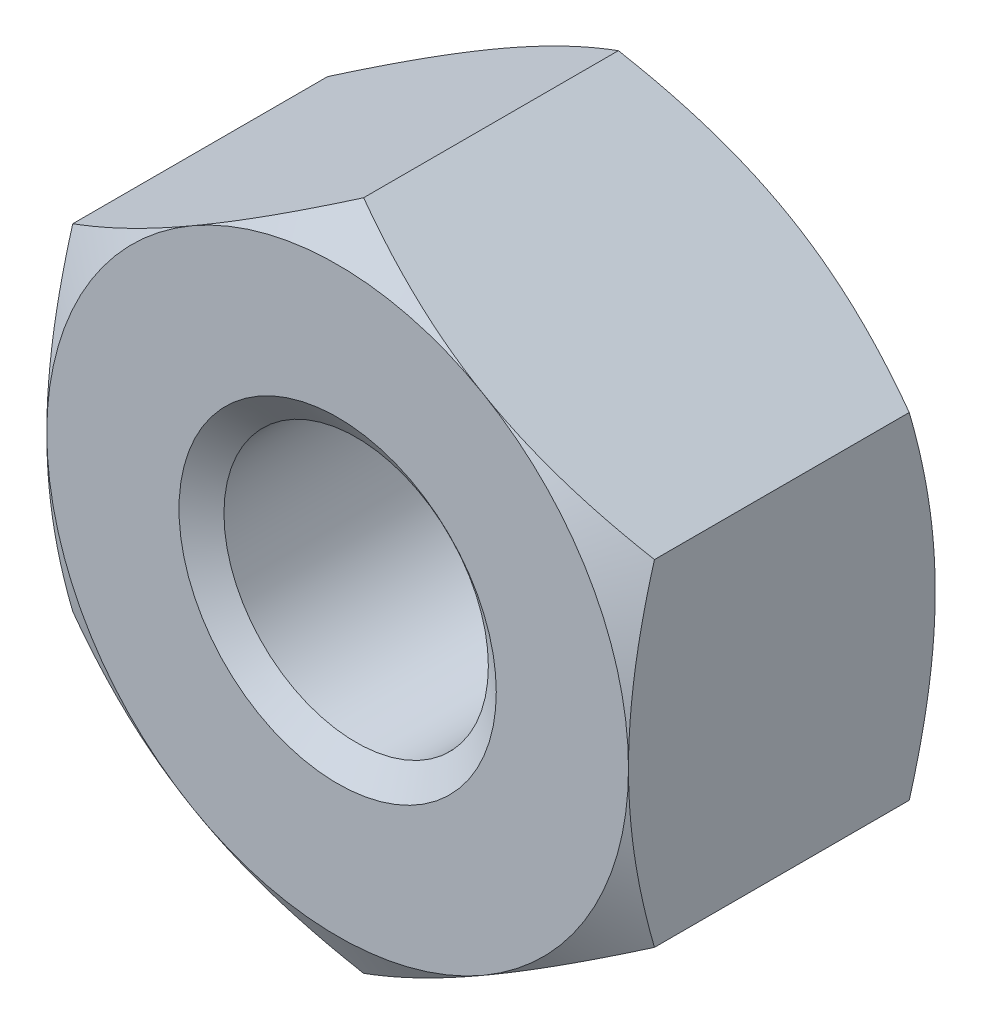
ISO-10303-21;
HEADER;
FILE_DESCRIPTION(('STEP AP214'),'2;1');
FILE_NAME('part.step','',(''),(''),'','','');
FILE_SCHEMA(('AUTOMOTIVE_DESIGN { 1 0 10303 214 1 1 1 1 }'));
ENDSEC;
DATA;
#1=APPLICATION_CONTEXT('core data for automotive mechanical design processes');
#2=APPLICATION_PROTOCOL_DEFINITION('international standard','automotive_design',2000,#1);
#3=PRODUCT_CONTEXT('',#1,'mechanical');
#4=PRODUCT('Part','Part','',(#3));
#5=PRODUCT_RELATED_PRODUCT_CATEGORY('part','',(#4));
#6=PRODUCT_DEFINITION_FORMATION('','',#4);
#7=PRODUCT_DEFINITION_CONTEXT('part definition',#1,'design');
#8=PRODUCT_DEFINITION('design','',#6,#7);
#9=PRODUCT_DEFINITION_SHAPE('','',#8);
#10=(LENGTH_UNIT() NAMED_UNIT(*) SI_UNIT(.MILLI.,.METRE.));
#11=(NAMED_UNIT(*) PLANE_ANGLE_UNIT() SI_UNIT($,.RADIAN.));
#12=(NAMED_UNIT(*) SI_UNIT($,.STERADIAN.) SOLID_ANGLE_UNIT());
#13=UNCERTAINTY_MEASURE_WITH_UNIT(LENGTH_MEASURE(1.E-05),#10,'distance_accuracy_value','');
#14=(GEOMETRIC_REPRESENTATION_CONTEXT(3) GLOBAL_UNCERTAINTY_ASSIGNED_CONTEXT((#13)) GLOBAL_UNIT_ASSIGNED_CONTEXT((#10,
#11,#12)) REPRESENTATION_CONTEXT('',''));
#15=CARTESIAN_POINT('',(0.,0.,0.));
#16=DIRECTION('',(0.,0.,1.));
#17=DIRECTION('',(1.,0.,0.));
#18=AXIS2_PLACEMENT_3D('',#15,#16,#17);
#19=CARTESIAN_POINT('',(0.,0.,-2.9));
#20=DIRECTION('',(0.,0.,1.));
#21=DIRECTION('',(1.,0.,0.));
#22=AXIS2_PLACEMENT_3D('',#19,#20,#21);
#23=CYLINDRICAL_SURFACE('',#22,1.25);
#24=CARTESIAN_POINT('',(0.,0.,-0.175051884552436));
#25=DIRECTION('',(0.,0.,1.));
#26=DIRECTION('',(1.,0.,0.));
#27=AXIS2_PLACEMENT_3D('',#24,#25,#26);
#28=CIRCLE('',#27,1.25);
#29=CARTESIAN_POINT('',(1.25,0.,-0.175051884552436));
#30=VERTEX_POINT('',#29);
#31=EDGE_CURVE('E175',#30,#30,#28,.F.);
#32=ORIENTED_EDGE('',*,*,#31,.F.);
#33=EDGE_LOOP('',(#32));
#34=FACE_BOUND('',#33,.T.);
#35=CARTESIAN_POINT('',(0.,0.,-2.69954811544756));
#36=DIRECTION('',(0.,0.,-1.));
#37=DIRECTION('',(-1.,0.,0.));
#38=AXIS2_PLACEMENT_3D('',#35,#36,#37);
#39=CIRCLE('',#38,1.25);
#40=CARTESIAN_POINT('',(-1.25,0.,-2.69954811544756));
#41=VERTEX_POINT('',#40);
#42=EDGE_CURVE('E40',#41,#41,#39,.F.);
#43=ORIENTED_EDGE('',*,*,#42,.F.);
#44=EDGE_LOOP('',(#43));
#45=FACE_BOUND('',#44,.T.);
#46=ADVANCED_FACE('F35',(#34,#45),#23,.F.);
#47=CARTESIAN_POINT('',(0.,3.17542648054296,-2.9));
#48=DIRECTION('',(-0.500000000000008,0.866025403784434,0.));
#49=DIRECTION('',(-0.866025403784434,-0.500000000000008,0.));
#50=AXIS2_PLACEMENT_3D('',#47,#48,#49);
#51=PLANE('',#50);
#52=DIRECTION('',(0.,0.,1.));
#53=VECTOR('',#52,1.);
#54=CARTESIAN_POINT('',(-2.75,1.58771324027145,-2.9));
#55=LINE('',#54,#53);
#56=CARTESIAN_POINT('',(-2.75,1.58771324027151,-2.65437990693813));
#57=VERTEX_POINT('',#56);
#58=CARTESIAN_POINT('',(-2.75,1.58771324027145,-0.245620093061857));
#59=VERTEX_POINT('',#58);
#60=EDGE_CURVE('E165',#57,#59,#55,.T.);
#61=ORIENTED_EDGE('',*,*,#60,.T.);
#62=CARTESIAN_POINT('',(-2.7502,1.58759777021761,-0.245686763364755));
#63=CARTESIAN_POINT('',(-2.62935077934009,1.65737010029697,-0.205387662249258));
#64=CARTESIAN_POINT('',(-2.50745839737737,1.72774469983531,-0.168736902597657));
#65=CARTESIAN_POINT('',(-2.26156287327211,1.86971254687001,-0.104762182969796));
#66=CARTESIAN_POINT('',(-2.13755536142615,1.94130831721582,-0.0774608556744926));
#67=CARTESIAN_POINT('',(-1.89107720202406,2.08361254889598,-0.0349617452941124));
#68=CARTESIAN_POINT('',(-1.76864448141259,2.15429911309863,-0.0194811186224536));
#69=CARTESIAN_POINT('',(-1.52320285763109,2.29600490065922,-0.000999397369936881));
#70=CARTESIAN_POINT('',(-1.4001948467671,2.36702360884403,0.00201700053740344));
#71=CARTESIAN_POINT('',(-1.17034121338921,2.49972966594897,-0.00425314542854458));
#72=CARTESIAN_POINT('',(-1.06346120874599,2.56143686540072,-0.012000154276701));
#73=CARTESIAN_POINT('',(-0.850397532665256,2.68444923614047,-0.036555181064355));
#74=CARTESIAN_POINT('',(-0.744214598351115,2.74575398185008,-0.0533715896505715));
#75=CARTESIAN_POINT('',(-0.530711510606819,2.86902004703207,-0.0954119223459598));
#76=CARTESIAN_POINT('',(-0.423418383857147,2.93096576264319,-0.120814080687235));
#77=CARTESIAN_POINT('',(-0.210432520715949,3.05393320806135,-0.178467225839989));
#78=CARTESIAN_POINT('',(-0.104737054973347,3.11495651365997,-0.210704663298991));
#79=CARTESIAN_POINT('',(0.000200000000001419,3.1755419505968,-0.245686763364771));
#80=B_SPLINE_CURVE_WITH_KNOTS('',3,(#62,#63,#64,#65,#66,#67,#68,#69,#70,#71,#72,#73,#74,#75,#76,
#77,#78,#79),.UNSPECIFIED.,.F.,.F.,(4,2,2,2,2,2,2,2,4),(0.,0.435912828725888,0.872873557116331,
1.29901931904671,1.72464171213573,2.09526089052938,2.46622354066375,2.84541551798559,
3.22386274754526),.UNSPECIFIED.);
#81=CARTESIAN_POINT('',(-1.37500000000002,2.3815698604072,0.));
#82=VERTEX_POINT('',#81);
#83=EDGE_CURVE('E134',#59,#82,#80,.T.);
#84=ORIENTED_EDGE('',*,*,#83,.T.);
#85=CARTESIAN_POINT('',(0.,3.17542648054296,-0.245620093061873));
#86=VERTEX_POINT('',#85);
#87=EDGE_CURVE('E54',#82,#86,#80,.T.);
#88=ORIENTED_EDGE('',*,*,#87,.T.);
#89=DIRECTION('',(0.,0.,1.));
#90=VECTOR('',#89,1.);
#91=CARTESIAN_POINT('',(0.,3.17542648054296,-2.9));
#92=LINE('',#91,#90);
#93=CARTESIAN_POINT('',(0.,3.17542648054296,-2.65437990693813));
#94=VERTEX_POINT('',#93);
#95=EDGE_CURVE('E150',#94,#86,#92,.T.);
#96=ORIENTED_EDGE('',*,*,#95,.F.);
#97=CARTESIAN_POINT('',(-2.7502,1.58759777021761,-2.65431323663524));
#98=CARTESIAN_POINT('',(-2.62935077934009,1.65737010029697,-2.69461233775074));
#99=CARTESIAN_POINT('',(-2.50745839737737,1.72774469983531,-2.73126309740234));
#100=CARTESIAN_POINT('',(-2.26156287327211,1.86971254687001,-2.7952378170302));
#101=CARTESIAN_POINT('',(-2.13755536142615,1.94130831721582,-2.82253914432551));
#102=CARTESIAN_POINT('',(-1.89107720202406,2.08361254889598,-2.86503825470589));
#103=CARTESIAN_POINT('',(-1.76864448141259,2.15429911309863,-2.88051888137755));
#104=CARTESIAN_POINT('',(-1.52320285763109,2.29600490065922,-2.89900060263006));
#105=CARTESIAN_POINT('',(-1.4001948467671,2.36702360884403,-2.9020170005374));
#106=CARTESIAN_POINT('',(-1.17034121338921,2.49972966594897,-2.89574685457146));
#107=CARTESIAN_POINT('',(-1.06346120874599,2.56143686540072,-2.8879998457233));
#108=CARTESIAN_POINT('',(-0.850397532665256,2.68444923614047,-2.86344481893564));
#109=CARTESIAN_POINT('',(-0.744214598351115,2.74575398185008,-2.84662841034943));
#110=CARTESIAN_POINT('',(-0.530711510606819,2.86902004703207,-2.80458807765404));
#111=CARTESIAN_POINT('',(-0.423418383857147,2.93096576264319,-2.77918591931276));
#112=CARTESIAN_POINT('',(-0.210432520715949,3.05393320806135,-2.72153277416001));
#113=CARTESIAN_POINT('',(-0.104737054973347,3.11495651365997,-2.68929533670101));
#114=CARTESIAN_POINT('',(0.000200000000001414,3.1755419505968,-2.65431323663523));
#115=B_SPLINE_CURVE_WITH_KNOTS('',3,(#97,#98,#99,#100,#101,#102,#103,#104,#105,#106,#107,#108,
#109,#110,#111,#112,#113,#114),.UNSPECIFIED.,.F.,.F.,(4,2,2,2,2,2,2,2,4),(0.,0.435912828725888,
0.872873557116332,1.29901931904671,1.72464171213573,2.09526089052938,2.46622354066375,
2.84541551798559,3.22386274754526),.UNSPECIFIED.);
#116=CARTESIAN_POINT('',(-1.37500000000002,2.3815698604072,-2.9));
#117=VERTEX_POINT('',#116);
#118=EDGE_CURVE('E168',#117,#94,#115,.T.);
#119=ORIENTED_EDGE('',*,*,#118,.F.);
#120=EDGE_CURVE('E260',#57,#117,#115,.T.);
#121=ORIENTED_EDGE('',*,*,#120,.F.);
#122=EDGE_LOOP('',(#61,#84,#88,#96,#119,#121));
#123=FACE_BOUND('',#122,.T.);
#124=ADVANCED_FACE('F37',(#123),#51,.T.);
#125=CARTESIAN_POINT('',(2.75,1.58771324027146,-2.9));
#126=DIRECTION('',(0.500000000000008,0.866025403784434,0.));
#127=DIRECTION('',(-0.866025403784434,0.500000000000008,0.));
#128=AXIS2_PLACEMENT_3D('',#125,#126,#127);
#129=PLANE('',#128);
#130=ORIENTED_EDGE('',*,*,#95,.T.);
#131=CARTESIAN_POINT('',(-0.00019999999999841,3.1755419505968,-0.245686763364771));
#132=CARTESIAN_POINT('',(0.120649220659908,3.10576962051744,-0.205387662249272));
#133=CARTESIAN_POINT('',(0.242541602622636,3.03539502097909,-0.16873690259767));
#134=CARTESIAN_POINT('',(0.488437126727895,2.8934271739444,-0.104762182969806));
#135=CARTESIAN_POINT('',(0.612444638573857,2.82183140359859,-0.0774608556745017));
#136=CARTESIAN_POINT('',(0.858922797975946,2.67952717191843,-0.0349617452941191));
#137=CARTESIAN_POINT('',(0.981355518587419,2.60884060771578,-0.0194811186224591));
#138=CARTESIAN_POINT('',(1.22679714236892,2.46713482015519,-0.000999397369940009));
#139=CARTESIAN_POINT('',(1.34980515323291,2.39611611197038,0.00201700053740151));
#140=CARTESIAN_POINT('',(1.5796587866108,2.26341005486544,-0.00425314542854448));
#141=CARTESIAN_POINT('',(1.68653879125402,2.20170285541368,-0.0120001542766998));
#142=CARTESIAN_POINT('',(1.89960246733475,2.07869048467394,-0.0365551810643516));
#143=CARTESIAN_POINT('',(2.00578540164889,2.01738573896433,-0.0533715896505668));
#144=CARTESIAN_POINT('',(2.21928848939318,1.89411967378234,-0.0954119223459524));
#145=CARTESIAN_POINT('',(2.32658161614286,1.83217395817122,-0.120814080687227));
#146=CARTESIAN_POINT('',(2.53956747928405,1.70920651275306,-0.178467225839978));
#147=CARTESIAN_POINT('',(2.64526294502665,1.64818320715445,-0.210704663298978));
#148=CARTESIAN_POINT('',(2.7502,1.58759777021762,-0.245686763364757));
#149=B_SPLINE_CURVE_WITH_KNOTS('',3,(#131,#132,#133,#134,#135,#136,#137,#138,#139,#140,#141,
#142,#143,#144,#145,#146,#147,#148),.UNSPECIFIED.,.F.,.F.,(4,2,2,2,2,2,2,2,4),(0.,
0.435912828725892,0.872873557116339,1.29901931904672,1.72464171213575,2.09526089052939,
2.46622354066376,2.84541551798559,3.22386274754526),.UNSPECIFIED.);
#150=CARTESIAN_POINT('',(1.37500000000002,2.3815698604072,0.));
#151=VERTEX_POINT('',#150);
#152=EDGE_CURVE('E144',#86,#151,#149,.T.);
#153=ORIENTED_EDGE('',*,*,#152,.T.);
#154=CARTESIAN_POINT('',(2.75,1.58771324027151,-0.245620093061873));
#155=VERTEX_POINT('',#154);
#156=EDGE_CURVE('E61',#151,#155,#149,.T.);
#157=ORIENTED_EDGE('',*,*,#156,.T.);
#158=DIRECTION('',(0.,0.,1.));
#159=VECTOR('',#158,1.);
#160=CARTESIAN_POINT('',(2.75,1.58771324027146,-2.9));
#161=LINE('',#160,#159);
#162=CARTESIAN_POINT('',(2.75,1.58771324027151,-2.65437990693813));
#163=VERTEX_POINT('',#162);
#164=EDGE_CURVE('E143',#163,#155,#161,.T.);
#165=ORIENTED_EDGE('',*,*,#164,.F.);
#166=CARTESIAN_POINT('',(-0.00019999999999841,3.1755419505968,-2.65431323663523));
#167=CARTESIAN_POINT('',(0.120649220659908,3.10576962051744,-2.69461233775073));
#168=CARTESIAN_POINT('',(0.242541602622636,3.03539502097909,-2.73126309740233));
#169=CARTESIAN_POINT('',(0.488437126727895,2.8934271739444,-2.79523781703019));
#170=CARTESIAN_POINT('',(0.612444638573858,2.82183140359859,-2.8225391443255));
#171=CARTESIAN_POINT('',(0.858922797975946,2.67952717191843,-2.86503825470588));
#172=CARTESIAN_POINT('',(0.98135551858742,2.60884060771578,-2.88051888137754));
#173=CARTESIAN_POINT('',(1.22679714236892,2.46713482015519,-2.89900060263006));
#174=CARTESIAN_POINT('',(1.34980515323291,2.39611611197038,-2.9020170005374));
#175=CARTESIAN_POINT('',(1.5796587866108,2.26341005486544,-2.89574685457146));
#176=CARTESIAN_POINT('',(1.68653879125402,2.20170285541368,-2.8879998457233));
#177=CARTESIAN_POINT('',(1.89960246733475,2.07869048467394,-2.86344481893565));
#178=CARTESIAN_POINT('',(2.00578540164889,2.01738573896433,-2.84662841034943));
#179=CARTESIAN_POINT('',(2.21928848939318,1.89411967378234,-2.80458807765405));
#180=CARTESIAN_POINT('',(2.32658161614285,1.83217395817122,-2.77918591931277));
#181=CARTESIAN_POINT('',(2.53956747928405,1.70920651275306,-2.72153277416002));
#182=CARTESIAN_POINT('',(2.64526294502665,1.64818320715445,-2.68929533670102));
#183=CARTESIAN_POINT('',(2.7502,1.58759777021762,-2.65431323663524));
#184=B_SPLINE_CURVE_WITH_KNOTS('',3,(#166,#167,#168,#169,#170,#171,#172,#173,#174,#175,#176,
#177,#178,#179,#180,#181,#182,#183),.UNSPECIFIED.,.F.,.F.,(4,2,2,2,2,2,2,2,4),(0.,
0.435912828725892,0.872873557116339,1.29901931904672,1.72464171213575,2.09526089052939,
2.46622354066376,2.84541551798558,3.22386274754526),.UNSPECIFIED.);
#185=CARTESIAN_POINT('',(1.37500000000002,2.3815698604072,-2.9));
#186=VERTEX_POINT('',#185);
#187=EDGE_CURVE('E254',#186,#163,#184,.T.);
#188=ORIENTED_EDGE('',*,*,#187,.F.);
#189=EDGE_CURVE('E259',#94,#186,#184,.T.);
#190=ORIENTED_EDGE('',*,*,#189,.F.);
#191=EDGE_LOOP('',(#130,#153,#157,#165,#188,#190));
#192=FACE_BOUND('',#191,.T.);
#193=ADVANCED_FACE('F141',(#192),#129,.T.);
#194=CARTESIAN_POINT('',(2.75,1.58771324027146,-2.9));
#195=DIRECTION('',(-1.,0.,0.));
#196=DIRECTION('',(0.,0.,1.));
#197=AXIS2_PLACEMENT_3D('',#194,#195,#196);
#198=PLANE('',#197);
#199=CARTESIAN_POINT('',(2.75,-4.21084949309679,-1.31594843960296));
#200=CARTESIAN_POINT('',(2.75,-4.09010894214093,-1.25759993615226));
#201=CARTESIAN_POINT('',(2.75,-3.96908292065512,-1.19983146511761));
#202=CARTESIAN_POINT('',(2.75,-3.72630558284847,-1.08578603842307));
#203=CARTESIAN_POINT('',(2.75,-3.60455414536203,-1.02950934100249));
#204=CARTESIAN_POINT('',(2.75,-3.35951393034357,-0.918482443352775));
#205=CARTESIAN_POINT('',(2.75,-3.23622034236439,-0.863742821605855));
#206=CARTESIAN_POINT('',(2.75,-2.98861980138746,-0.75661477747647));
#207=CARTESIAN_POINT('',(2.75,-2.86431290161185,-0.704226232536779));
#208=CARTESIAN_POINT('',(2.75,-2.61294485887175,-0.601803572146137));
#209=CARTESIAN_POINT('',(2.75,-2.48586863815657,-0.551806257898406));
#210=CARTESIAN_POINT('',(2.75,-2.23021732171543,-0.455727408784612));
#211=CARTESIAN_POINT('',(2.75,-2.10164206103366,-0.409646309576982));
#212=CARTESIAN_POINT('',(2.75,-1.8430521879947,-0.32263807704624));
#213=CARTESIAN_POINT('',(2.75,-1.71304130052586,-0.281699986413896));
#214=CARTESIAN_POINT('',(2.75,-1.4511712506215,-0.206307307624354));
#215=CARTESIAN_POINT('',(2.75,-1.31931268690205,-0.171850669152772));
#216=CARTESIAN_POINT('',(2.75,-1.05365722480015,-0.111093671530907));
#217=CARTESIAN_POINT('',(2.75,-0.919859820217614,-0.084795484095124));
#218=CARTESIAN_POINT('',(2.75,-0.650651874037403,-0.0421260371966123));
#219=CARTESIAN_POINT('',(2.75,-0.515241331013616,-0.0257547865105436));
#220=CARTESIAN_POINT('',(2.75,-0.244373242869231,-0.00438749654023665));
#221=CARTESIAN_POINT('',(2.75,-0.108921526377152,0.000680556773217393));
#222=CARTESIAN_POINT('',(2.75,0.161887058855116,-0.000827795632669437));
#223=CARTESIAN_POINT('',(2.75,0.297243943089623,-0.00740117868555063));
#224=CARTESIAN_POINT('',(2.75,0.528385436717524,-0.02810413004684));
#225=CARTESIAN_POINT('',(2.75,0.62442505013748,-0.039537641030184));
#226=CARTESIAN_POINT('',(2.75,0.81576239981152,-0.0675217196133457));
#227=CARTESIAN_POINT('',(2.75,0.911060016631941,-0.0840730942276763));
#228=CARTESIAN_POINT('',(2.75,1.19576218748914,-0.140535361278277));
#229=CARTESIAN_POINT('',(2.75,1.38383224738493,-0.187239859417285));
#230=CARTESIAN_POINT('',(2.75,1.66525048947482,-0.267792497030568));
#231=CARTESIAN_POINT('',(2.75,1.76006556248554,-0.296803334995489));
#232=CARTESIAN_POINT('',(2.75,1.94870609382211,-0.357695648906575));
#233=CARTESIAN_POINT('',(2.75,2.04253218553692,-0.38957514487849));
#234=CARTESIAN_POINT('',(2.75,2.2288024035498,-0.455541418186434));
#235=CARTESIAN_POINT('',(2.75,2.32125133588447,-0.489614761455518));
#236=CARTESIAN_POINT('',(2.75,2.50543192042624,-0.559761368231093));
#237=CARTESIAN_POINT('',(2.75,2.59716326539574,-0.595835440037301));
#238=CARTESIAN_POINT('',(2.75,2.68856293053341,-0.632712441997467));
#239=B_SPLINE_CURVE_WITH_KNOTS('',3,(#199,#200,#201,#202,#203,#204,#205,#206,#207,#208,#209,
#210,#211,#212,#213,#214,#215,#216,#217,#218,#219,#220,#221,#222,#223,#224,#225,#226,#227,#228,
#229,#230,#231,#232,#233,#234,#235,#236,#237,#238),.UNSPECIFIED.,.F.,.F.,(4,2,2,2,2,2,2,2,2,2,2,
2,2,2,2,2,2,2,2,4),(0.,0.402305607365937,0.804680408536998,1.20935783819118,1.61401414820819,
2.0236383818577,2.43330812457349,2.84208969479601,3.25074173456637,3.65950246109145,
4.06826354901185,4.47441284024652,4.88045669141174,5.17046846817547,5.46052599902453,
6.04107275309883,6.33851131304661,6.63574613017454,6.93130791005791,7.22698998004821),.UNSPECIFIED.);
#240=CARTESIAN_POINT('',(2.75000000000001,-1.58771324027149,-0.245620093061873));
#241=VERTEX_POINT('',#240);
#242=CARTESIAN_POINT('',(2.75,0.,0.));
#243=VERTEX_POINT('',#242);
#244=EDGE_CURVE('E136',#241,#243,#239,.T.);
#245=ORIENTED_EDGE('',*,*,#244,.F.);
#246=DIRECTION('',(0.,0.,1.));
#247=VECTOR('',#246,1.);
#248=CARTESIAN_POINT('',(2.75,-1.5877132402715,-2.9));
#249=LINE('',#248,#247);
#250=CARTESIAN_POINT('',(2.75000000000001,-1.58771324027149,-2.65437990693813));
#251=VERTEX_POINT('',#250);
#252=EDGE_CURVE('E151',#251,#241,#249,.T.);
#253=ORIENTED_EDGE('',*,*,#252,.F.);
#254=CARTESIAN_POINT('',(2.75,-4.21084949309679,-1.58405156039704));
#255=CARTESIAN_POINT('',(2.75,-4.09010894214093,-1.64240006384774));
#256=CARTESIAN_POINT('',(2.75,-3.96908292065512,-1.70016853488239));
#257=CARTESIAN_POINT('',(2.75,-3.72630558284846,-1.81421396157693));
#258=CARTESIAN_POINT('',(2.75,-3.60455414536203,-1.87049065899751));
#259=CARTESIAN_POINT('',(2.75,-3.35951393034357,-1.98151755664723));
#260=CARTESIAN_POINT('',(2.75,-3.23622034236439,-2.03625717839415));
#261=CARTESIAN_POINT('',(2.75,-2.98861980138746,-2.14338522252353));
#262=CARTESIAN_POINT('',(2.75,-2.86431290161185,-2.19577376746322));
#263=CARTESIAN_POINT('',(2.75,-2.61294485887175,-2.29819642785386));
#264=CARTESIAN_POINT('',(2.75,-2.48586863815657,-2.34819374210159));
#265=CARTESIAN_POINT('',(2.75,-2.23021732171543,-2.44427259121539));
#266=CARTESIAN_POINT('',(2.75,-2.10164206103366,-2.49035369042302));
#267=CARTESIAN_POINT('',(2.75,-1.8430521879947,-2.57736192295376));
#268=CARTESIAN_POINT('',(2.75,-1.71304130052586,-2.6183000135861));
#269=CARTESIAN_POINT('',(2.75,-1.4511712506215,-2.69369269237565));
#270=CARTESIAN_POINT('',(2.75,-1.31931268690205,-2.72814933084723));
#271=CARTESIAN_POINT('',(2.75,-1.05365722480015,-2.78890632846909));
#272=CARTESIAN_POINT('',(2.75,-0.919859820217613,-2.81520451590488));
#273=CARTESIAN_POINT('',(2.75,-0.650651874037402,-2.85787396280339));
#274=CARTESIAN_POINT('',(2.75,-0.515241331013616,-2.87424521348946));
#275=CARTESIAN_POINT('',(2.75,-0.244373242869231,-2.89561250345976));
#276=CARTESIAN_POINT('',(2.75,-0.108921526377152,-2.90068055677322));
#277=CARTESIAN_POINT('',(2.75,0.161887058855116,-2.89917220436733));
#278=CARTESIAN_POINT('',(2.75,0.297243943089623,-2.89259882131445));
#279=CARTESIAN_POINT('',(2.75,0.528385436717523,-2.87189586995316));
#280=CARTESIAN_POINT('',(2.75,0.62442505013748,-2.86046235896982));
#281=CARTESIAN_POINT('',(2.75,0.81576239981152,-2.83247828038665));
#282=CARTESIAN_POINT('',(2.75,0.911060016631941,-2.81592690577232));
#283=CARTESIAN_POINT('',(2.75,1.19576218748914,-2.75946463872172));
#284=CARTESIAN_POINT('',(2.75,1.38383224738493,-2.71276014058271));
#285=CARTESIAN_POINT('',(2.75,1.66525048947482,-2.63220750296943));
#286=CARTESIAN_POINT('',(2.75,1.76006556248554,-2.60319666500451));
#287=CARTESIAN_POINT('',(2.75,1.94870609382211,-2.54230435109342));
#288=CARTESIAN_POINT('',(2.75,2.04253218553692,-2.51042485512151));
#289=CARTESIAN_POINT('',(2.75,2.2288024035498,-2.44445858181357));
#290=CARTESIAN_POINT('',(2.75,2.32125133588447,-2.41038523854448));
#291=CARTESIAN_POINT('',(2.75,2.50543192042624,-2.34023863176891));
#292=CARTESIAN_POINT('',(2.75,2.59716326539574,-2.3041645599627));
#293=CARTESIAN_POINT('',(2.75,2.68856293053341,-2.26728755800253));
#294=B_SPLINE_CURVE_WITH_KNOTS('',3,(#254,#255,#256,#257,#258,#259,#260,#261,#262,#263,#264,
#265,#266,#267,#268,#269,#270,#271,#272,#273,#274,#275,#276,#277,#278,#279,#280,#281,#282,#283,
#284,#285,#286,#287,#288,#289,#290,#291,#292,#293),.UNSPECIFIED.,.F.,.F.,(4,2,2,2,2,2,2,2,2,2,2,
2,2,2,2,2,2,2,2,4),(0.,0.402305607365938,0.804680408536999,1.20935783819118,1.61401414820819,
2.0236383818577,2.43330812457349,2.84208969479601,3.25074173456637,3.65950246109145,
4.06826354901185,4.47441284024652,4.88045669141174,5.17046846817547,5.46052599902453,
6.04107275309883,6.33851131304661,6.63574613017454,6.93130791005791,7.22698998004821),.UNSPECIFIED.);
#295=CARTESIAN_POINT('',(2.75,0.,-2.9));
#296=VERTEX_POINT('',#295);
#297=EDGE_CURVE('E266',#251,#296,#294,.T.);
#298=ORIENTED_EDGE('',*,*,#297,.T.);
#299=EDGE_CURVE('E149',#296,#163,#294,.T.);
#300=ORIENTED_EDGE('',*,*,#299,.T.);
#301=ORIENTED_EDGE('',*,*,#164,.T.);
#302=EDGE_CURVE('E126',#243,#155,#239,.T.);
#303=ORIENTED_EDGE('',*,*,#302,.F.);
#304=EDGE_LOOP('',(#245,#253,#298,#300,#301,#303));
#305=FACE_BOUND('',#304,.T.);
#306=ADVANCED_FACE('F147',(#305),#198,.F.);
#307=CARTESIAN_POINT('',(0.,-3.175426480543,-2.9));
#308=DIRECTION('',(0.500000000000007,-0.866025403784435,0.));
#309=DIRECTION('',(0.866025403784435,0.500000000000007,0.));
#310=AXIS2_PLACEMENT_3D('',#307,#308,#309);
#311=PLANE('',#310);
#312=ORIENTED_EDGE('',*,*,#252,.T.);
#313=CARTESIAN_POINT('',(2.7502,-1.58759777021766,-0.245686763364769));
#314=CARTESIAN_POINT('',(2.62935077934009,-1.65737010029702,-0.205387662249272));
#315=CARTESIAN_POINT('',(2.50745839737736,-1.72774469983536,-0.168736902597671));
#316=CARTESIAN_POINT('',(2.2615628732721,-1.86971254687006,-0.104762182969811));
#317=CARTESIAN_POINT('',(2.13755536142614,-1.94130831721586,-0.0774608556745088));
#318=CARTESIAN_POINT('',(1.89107720202405,-2.08361254889603,-0.0349617452941302));
#319=CARTESIAN_POINT('',(1.76864448141258,-2.15429911309868,-0.0194811186224723));
#320=CARTESIAN_POINT('',(1.52320285763108,-2.29600490065927,-0.000999397369957487));
#321=CARTESIAN_POINT('',(1.40019484676708,-2.36702360884408,0.00201700053738184));
#322=CARTESIAN_POINT('',(1.1703412133892,-2.49972966594902,-0.00425314542856775));
#323=CARTESIAN_POINT('',(1.06346120874597,-2.56143686540077,-0.0120001542767246));
#324=CARTESIAN_POINT('',(0.850397532665247,-2.68444923614051,-0.0365551810643794));
#325=CARTESIAN_POINT('',(0.744214598351108,-2.74575398185013,-0.0533715896505962));
#326=CARTESIAN_POINT('',(0.530711510606814,-2.86902004703211,-0.0954119223459845));
#327=CARTESIAN_POINT('',(0.423418383857143,-2.93096576264323,-0.12081408068726));
#328=CARTESIAN_POINT('',(0.210432520715948,-3.05393320806139,-0.178467225840013));
#329=CARTESIAN_POINT('',(0.104737054973348,-3.11495651366001,-0.210704663299014));
#330=CARTESIAN_POINT('',(-0.000199999999998988,-3.17554195059683,-0.245686763364793));
#331=B_SPLINE_CURVE_WITH_KNOTS('',3,(#313,#314,#315,#316,#317,#318,#319,#320,#321,#322,#323,
#324,#325,#326,#327,#328,#329,#330),.UNSPECIFIED.,.F.,.F.,(4,2,2,2,2,2,2,2,4),(0.,
0.435912828725891,0.872873557116337,1.29901931904672,1.72464171213575,2.09526089052939,
2.46622354066375,2.84541551798558,3.22386274754526),.UNSPECIFIED.);
#332=CARTESIAN_POINT('',(1.37500000000002,-2.3815698604072,0.));
#333=VERTEX_POINT('',#332);
#334=EDGE_CURVE('E360',#241,#333,#331,.T.);
#335=ORIENTED_EDGE('',*,*,#334,.T.);
#336=CARTESIAN_POINT('',(0.,-3.17542648054296,-0.245620093061873));
#337=VERTEX_POINT('',#336);
#338=EDGE_CURVE('E226',#333,#337,#331,.T.);
#339=ORIENTED_EDGE('',*,*,#338,.T.);
#340=DIRECTION('',(0.,0.,1.));
#341=VECTOR('',#340,1.);
#342=CARTESIAN_POINT('',(0.,-3.175426480543,-2.9));
#343=LINE('',#342,#341);
#344=CARTESIAN_POINT('',(0.,-3.17542648054296,-2.65437990693813));
#345=VERTEX_POINT('',#344);
#346=EDGE_CURVE('E156',#345,#337,#343,.T.);
#347=ORIENTED_EDGE('',*,*,#346,.F.);
#348=CARTESIAN_POINT('',(2.7502,-1.58759777021766,-2.65431323663523));
#349=CARTESIAN_POINT('',(2.62935077934009,-1.65737010029702,-2.69461233775073));
#350=CARTESIAN_POINT('',(2.50745839737736,-1.72774469983536,-2.73126309740233));
#351=CARTESIAN_POINT('',(2.2615628732721,-1.86971254687006,-2.79523781703019));
#352=CARTESIAN_POINT('',(2.13755536142614,-1.94130831721586,-2.82253914432549));
#353=CARTESIAN_POINT('',(1.89107720202405,-2.08361254889603,-2.86503825470587));
#354=CARTESIAN_POINT('',(1.76864448141258,-2.15429911309868,-2.88051888137753));
#355=CARTESIAN_POINT('',(1.52320285763108,-2.29600490065927,-2.89900060263004));
#356=CARTESIAN_POINT('',(1.40019484676708,-2.36702360884408,-2.90201700053738));
#357=CARTESIAN_POINT('',(1.1703412133892,-2.49972966594902,-2.89574685457143));
#358=CARTESIAN_POINT('',(1.06346120874597,-2.56143686540077,-2.88799984572328));
#359=CARTESIAN_POINT('',(0.850397532665247,-2.68444923614051,-2.86344481893562));
#360=CARTESIAN_POINT('',(0.744214598351108,-2.74575398185013,-2.8466284103494));
#361=CARTESIAN_POINT('',(0.530711510606815,-2.86902004703211,-2.80458807765402));
#362=CARTESIAN_POINT('',(0.423418383857144,-2.93096576264323,-2.77918591931274));
#363=CARTESIAN_POINT('',(0.210432520715949,-3.05393320806139,-2.72153277415999));
#364=CARTESIAN_POINT('',(0.104737054973348,-3.11495651366,-2.68929533670099));
#365=CARTESIAN_POINT('',(-0.000199999999998861,-3.17554195059683,-2.65431323663521));
#366=B_SPLINE_CURVE_WITH_KNOTS('',3,(#348,#349,#350,#351,#352,#353,#354,#355,#356,#357,#358,
#359,#360,#361,#362,#363,#364,#365),.UNSPECIFIED.,.F.,.F.,(4,2,2,2,2,2,2,2,4),(0.,
0.435912828725891,0.872873557116338,1.29901931904672,1.72464171213575,2.09526089052939,
2.46622354066375,2.84541551798558,3.22386274754526),.UNSPECIFIED.);
#367=CARTESIAN_POINT('',(1.37500000000002,-2.3815698604072,-2.9));
#368=VERTEX_POINT('',#367);
#369=EDGE_CURVE('E272',#368,#345,#366,.T.);
#370=ORIENTED_EDGE('',*,*,#369,.F.);
#371=EDGE_CURVE('E271',#251,#368,#366,.T.);
#372=ORIENTED_EDGE('',*,*,#371,.F.);
#373=EDGE_LOOP('',(#312,#335,#339,#347,#370,#372));
#374=FACE_BOUND('',#373,.T.);
#375=ADVANCED_FACE('F282',(#374),#311,.T.);
#376=CARTESIAN_POINT('',(-2.75,-1.5877132402715,-2.9));
#377=DIRECTION('',(-0.500000000000006,-0.866025403784435,0.));
#378=DIRECTION('',(0.866025403784435,-0.500000000000006,0.));
#379=AXIS2_PLACEMENT_3D('',#376,#377,#378);
#380=PLANE('',#379);
#381=ORIENTED_EDGE('',*,*,#346,.T.);
#382=CARTESIAN_POINT('',(0.000200000000001002,-3.17554195059683,-0.245686763364793));
#383=CARTESIAN_POINT('',(-0.120649220659907,-3.10576962051748,-0.205387662249294));
#384=CARTESIAN_POINT('',(-0.242541602622636,-3.03539502097913,-0.168736902597691));
#385=CARTESIAN_POINT('',(-0.488437126727898,-2.89342717394443,-0.104762182969827));
#386=CARTESIAN_POINT('',(-0.612444638573863,-2.82183140359863,-0.0774608556745226));
#387=CARTESIAN_POINT('',(-0.858922797975955,-2.67952717191846,-0.0349617452941396));
#388=CARTESIAN_POINT('',(-0.98135551858743,-2.60884060771581,-0.0194811186224794));
#389=CARTESIAN_POINT('',(-1.22679714236893,-2.46713482015522,-0.000999397369960387));
#390=CARTESIAN_POINT('',(-1.34980515323293,-2.39611611197041,0.00201700053738092));
#391=CARTESIAN_POINT('',(-1.57965878661081,-2.26341005486547,-0.00425314542856523));
#392=CARTESIAN_POINT('',(-1.68653879125404,-2.20170285541372,-0.0120001542767203));
#393=CARTESIAN_POINT('',(-1.89960246733476,-2.07869048467398,-0.0365551810643714));
#394=CARTESIAN_POINT('',(-2.0057854016489,-2.01738573896436,-0.0533715896505862));
#395=CARTESIAN_POINT('',(-2.21928848939319,-1.89411967378238,-0.0954119223459706));
#396=CARTESIAN_POINT('',(-2.32658161614286,-1.83217395817126,-0.120814080687244));
#397=CARTESIAN_POINT('',(-2.53956747928405,-1.70920651275311,-0.178467225839993));
#398=CARTESIAN_POINT('',(-2.64526294502665,-1.64818320715449,-0.210704663298993));
#399=CARTESIAN_POINT('',(-2.7502,-1.58759777021766,-0.24568676336477));
#400=B_SPLINE_CURVE_WITH_KNOTS('',3,(#382,#383,#384,#385,#386,#387,#388,#389,#390,#391,#392,
#393,#394,#395,#396,#397,#398,#399),.UNSPECIFIED.,.F.,.F.,(4,2,2,2,2,2,2,2,4),(0.,
0.435912828725896,0.872873557116349,1.29901931904674,1.72464171213577,2.0952608905294,
2.46622354066377,2.84541551798559,3.22386274754526),.UNSPECIFIED.);
#401=CARTESIAN_POINT('',(-1.37500000000002,-2.3815698604072,0.));
#402=VERTEX_POINT('',#401);
#403=EDGE_CURVE('E357',#337,#402,#400,.T.);
#404=ORIENTED_EDGE('',*,*,#403,.T.);
#405=CARTESIAN_POINT('',(-2.75,-1.58771324027151,-0.245620093061873));
#406=VERTEX_POINT('',#405);
#407=EDGE_CURVE('E200',#402,#406,#400,.T.);
#408=ORIENTED_EDGE('',*,*,#407,.T.);
#409=DIRECTION('',(0.,0.,1.));
#410=VECTOR('',#409,1.);
#411=CARTESIAN_POINT('',(-2.75,-1.5877132402715,-2.9));
#412=LINE('',#411,#410);
#413=CARTESIAN_POINT('',(-2.75,-1.58771324027151,-2.65437990693813));
#414=VERTEX_POINT('',#413);
#415=EDGE_CURVE('E162',#414,#406,#412,.T.);
#416=ORIENTED_EDGE('',*,*,#415,.F.);
#417=CARTESIAN_POINT('',(0.000200000000001002,-3.17554195059683,-2.65431323663521));
#418=CARTESIAN_POINT('',(-0.120649220659907,-3.10576962051748,-2.69461233775071));
#419=CARTESIAN_POINT('',(-0.242541602622636,-3.03539502097913,-2.73126309740231));
#420=CARTESIAN_POINT('',(-0.488437126727899,-2.89342717394443,-2.79523781703017));
#421=CARTESIAN_POINT('',(-0.612444638573863,-2.82183140359863,-2.82253914432548));
#422=CARTESIAN_POINT('',(-0.858922797975955,-2.67952717191846,-2.86503825470586));
#423=CARTESIAN_POINT('',(-0.98135551858743,-2.60884060771581,-2.88051888137752));
#424=CARTESIAN_POINT('',(-1.22679714236893,-2.46713482015522,-2.89900060263004));
#425=CARTESIAN_POINT('',(-1.34980515323293,-2.39611611197041,-2.90201700053738));
#426=CARTESIAN_POINT('',(-1.57965878661081,-2.26341005486547,-2.89574685457143));
#427=CARTESIAN_POINT('',(-1.68653879125404,-2.20170285541372,-2.88799984572328));
#428=CARTESIAN_POINT('',(-1.89960246733476,-2.07869048467398,-2.86344481893563));
#429=CARTESIAN_POINT('',(-2.0057854016489,-2.01738573896436,-2.84662841034941));
#430=CARTESIAN_POINT('',(-2.21928848939319,-1.89411967378238,-2.80458807765403));
#431=CARTESIAN_POINT('',(-2.32658161614286,-1.83217395817126,-2.77918591931276));
#432=CARTESIAN_POINT('',(-2.53956747928405,-1.70920651275311,-2.72153277416001));
#433=CARTESIAN_POINT('',(-2.64526294502665,-1.64818320715449,-2.68929533670101));
#434=CARTESIAN_POINT('',(-2.7502,-1.58759777021766,-2.65431323663523));
#435=B_SPLINE_CURVE_WITH_KNOTS('',3,(#417,#418,#419,#420,#421,#422,#423,#424,#425,#426,#427,
#428,#429,#430,#431,#432,#433,#434),.UNSPECIFIED.,.F.,.F.,(4,2,2,2,2,2,2,2,4),(0.,
0.435912828725897,0.872873557116349,1.29901931904674,1.72464171213577,2.0952608905294,
2.46622354066377,2.84541551798559,3.22386274754526),.UNSPECIFIED.);
#436=CARTESIAN_POINT('',(-1.37500000000002,-2.3815698604072,-2.9));
#437=VERTEX_POINT('',#436);
#438=EDGE_CURVE('E278',#437,#414,#435,.T.);
#439=ORIENTED_EDGE('',*,*,#438,.F.);
#440=EDGE_CURVE('E277',#345,#437,#435,.T.);
#441=ORIENTED_EDGE('',*,*,#440,.F.);
#442=EDGE_LOOP('',(#381,#404,#408,#416,#439,#441));
#443=FACE_BOUND('',#442,.T.);
#444=ADVANCED_FACE('F285',(#443),#380,.T.);
#445=CARTESIAN_POINT('',(-2.75,1.58771324027145,-2.9));
#446=DIRECTION('',(-1.,0.,0.));
#447=DIRECTION('',(0.,0.,1.));
#448=AXIS2_PLACEMENT_3D('',#445,#446,#447);
#449=PLANE('',#448);
#450=ORIENTED_EDGE('',*,*,#415,.T.);
#451=CARTESIAN_POINT('',(-2.75,-4.21084949309679,-1.31594843960296));
#452=CARTESIAN_POINT('',(-2.75,-4.09010894214093,-1.25759993615227));
#453=CARTESIAN_POINT('',(-2.75,-3.96908292065512,-1.19983146511761));
#454=CARTESIAN_POINT('',(-2.75,-3.72630558284847,-1.08578603842307));
#455=CARTESIAN_POINT('',(-2.75,-3.60455414536203,-1.02950934100249));
#456=CARTESIAN_POINT('',(-2.75,-3.35951393034358,-0.918482443352777));
#457=CARTESIAN_POINT('',(-2.75,-3.2362203423644,-0.863742821605856));
#458=CARTESIAN_POINT('',(-2.75,-2.98861980138747,-0.756614777476471));
#459=CARTESIAN_POINT('',(-2.75,-2.86431290161185,-0.70422623253678));
#460=CARTESIAN_POINT('',(-2.75,-2.61294485887175,-0.601803572146139));
#461=CARTESIAN_POINT('',(-2.75,-2.48586863815657,-0.551806257898408));
#462=CARTESIAN_POINT('',(-2.75,-2.23021732171544,-0.455727408784613));
#463=CARTESIAN_POINT('',(-2.75,-2.10164206103366,-0.409646309576983));
#464=CARTESIAN_POINT('',(-2.75,-1.8430521879947,-0.322638077046241));
#465=CARTESIAN_POINT('',(-2.75,-1.71304130052586,-0.281699986413897));
#466=CARTESIAN_POINT('',(-2.75,-1.4511712506215,-0.206307307624355));
#467=CARTESIAN_POINT('',(-2.75,-1.31931268690205,-0.171850669152773));
#468=CARTESIAN_POINT('',(-2.75,-1.05365722480015,-0.111093671530908));
#469=CARTESIAN_POINT('',(-2.75,-0.919859820217618,-0.0847954840951249));
#470=CARTESIAN_POINT('',(-2.75,-0.650651874037407,-0.0421260371966128));
#471=CARTESIAN_POINT('',(-2.75,-0.51524133101362,-0.0257547865105438));
#472=CARTESIAN_POINT('',(-2.75,-0.244373242869235,-0.00438749654023648));
#473=CARTESIAN_POINT('',(-2.75,-0.108921526377157,0.00068055677321763));
#474=CARTESIAN_POINT('',(-2.75,0.161887058855112,-0.000827795632669175));
#475=CARTESIAN_POINT('',(-2.75,0.297243943089619,-0.00740117868555047));
#476=CARTESIAN_POINT('',(-2.75,0.52838543671752,-0.0281041300468396));
#477=CARTESIAN_POINT('',(-2.75,0.624425050137476,-0.0395376410301834));
#478=CARTESIAN_POINT('',(-2.75,0.815762399811516,-0.0675217196133449));
#479=CARTESIAN_POINT('',(-2.75,0.911060016631937,-0.0840730942276756));
#480=CARTESIAN_POINT('',(-2.75,1.19576218748913,-0.140535361278276));
#481=CARTESIAN_POINT('',(-2.75,1.38383224738493,-0.187239859417283));
#482=CARTESIAN_POINT('',(-2.75,1.66525048947481,-0.267792497030566));
#483=CARTESIAN_POINT('',(-2.75,1.76006556248554,-0.296803334995488));
#484=CARTESIAN_POINT('',(-2.75,1.94870609382211,-0.357695648906574));
#485=CARTESIAN_POINT('',(-2.75,2.04253218553691,-0.389575144878489));
#486=CARTESIAN_POINT('',(-2.75,2.2288024035498,-0.455541418186432));
#487=CARTESIAN_POINT('',(-2.75,2.32125133588446,-0.489614761455516));
#488=CARTESIAN_POINT('',(-2.75,2.50543192042623,-0.559761368231091));
#489=CARTESIAN_POINT('',(-2.75,2.59716326539574,-0.595835440037299));
#490=CARTESIAN_POINT('',(-2.75,2.6885629305334,-0.632712441997465));
#491=B_SPLINE_CURVE_WITH_KNOTS('',3,(#451,#452,#453,#454,#455,#456,#457,#458,#459,#460,#461,
#462,#463,#464,#465,#466,#467,#468,#469,#470,#471,#472,#473,#474,#475,#476,#477,#478,#479,#480,
#481,#482,#483,#484,#485,#486,#487,#488,#489,#490),.UNSPECIFIED.,.F.,.F.,(4,2,2,2,2,2,2,2,2,2,2,
2,2,2,2,2,2,2,2,4),(0.,0.402305607365937,0.804680408536999,1.20935783819118,1.61401414820819,
2.0236383818577,2.43330812457349,2.84208969479601,3.25074173456637,3.65950246109145,
4.06826354901185,4.47441284024652,4.88045669141174,5.17046846817547,5.46052599902453,
6.04107275309883,6.33851131304661,6.63574613017454,6.93130791005791,7.22698998004821),.UNSPECIFIED.);
#492=CARTESIAN_POINT('',(-2.75,0.,0.));
#493=VERTEX_POINT('',#492);
#494=EDGE_CURVE('E199',#406,#493,#491,.T.);
#495=ORIENTED_EDGE('',*,*,#494,.T.);
#496=EDGE_CURVE('E192',#493,#59,#491,.T.);
#497=ORIENTED_EDGE('',*,*,#496,.T.);
#498=ORIENTED_EDGE('',*,*,#60,.F.);
#499=CARTESIAN_POINT('',(-2.75,-4.21084949309679,-1.58405156039704));
#500=CARTESIAN_POINT('',(-2.75,-4.09010894214093,-1.64240006384773));
#501=CARTESIAN_POINT('',(-2.75,-3.96908292065512,-1.70016853488239));
#502=CARTESIAN_POINT('',(-2.75,-3.72630558284847,-1.81421396157693));
#503=CARTESIAN_POINT('',(-2.75,-3.60455414536203,-1.87049065899751));
#504=CARTESIAN_POINT('',(-2.75,-3.35951393034358,-1.98151755664722));
#505=CARTESIAN_POINT('',(-2.75,-3.2362203423644,-2.03625717839414));
#506=CARTESIAN_POINT('',(-2.75,-2.98861980138747,-2.14338522252353));
#507=CARTESIAN_POINT('',(-2.75,-2.86431290161185,-2.19577376746322));
#508=CARTESIAN_POINT('',(-2.75,-2.61294485887175,-2.29819642785386));
#509=CARTESIAN_POINT('',(-2.75,-2.48586863815657,-2.34819374210159));
#510=CARTESIAN_POINT('',(-2.75,-2.23021732171544,-2.44427259121539));
#511=CARTESIAN_POINT('',(-2.75,-2.10164206103366,-2.49035369042302));
#512=CARTESIAN_POINT('',(-2.75,-1.8430521879947,-2.57736192295376));
#513=CARTESIAN_POINT('',(-2.75,-1.71304130052586,-2.6183000135861));
#514=CARTESIAN_POINT('',(-2.75,-1.4511712506215,-2.69369269237564));
#515=CARTESIAN_POINT('',(-2.75,-1.31931268690205,-2.72814933084723));
#516=CARTESIAN_POINT('',(-2.75,-1.05365722480015,-2.78890632846909));
#517=CARTESIAN_POINT('',(-2.75,-0.919859820217618,-2.81520451590488));
#518=CARTESIAN_POINT('',(-2.75,-0.650651874037407,-2.85787396280339));
#519=CARTESIAN_POINT('',(-2.75,-0.51524133101362,-2.87424521348946));
#520=CARTESIAN_POINT('',(-2.75,-0.244373242869234,-2.89561250345976));
#521=CARTESIAN_POINT('',(-2.75,-0.108921526377156,-2.90068055677322));
#522=CARTESIAN_POINT('',(-2.75,0.161887058855113,-2.89917220436733));
#523=CARTESIAN_POINT('',(-2.75,0.297243943089619,-2.89259882131445));
#524=CARTESIAN_POINT('',(-2.75,0.52838543671752,-2.87189586995316));
#525=CARTESIAN_POINT('',(-2.75,0.624425050137477,-2.86046235896982));
#526=CARTESIAN_POINT('',(-2.75,0.815762399811517,-2.83247828038665));
#527=CARTESIAN_POINT('',(-2.75,0.911060016631938,-2.81592690577232));
#528=CARTESIAN_POINT('',(-2.75,1.19576218748913,-2.75946463872172));
#529=CARTESIAN_POINT('',(-2.75,1.38383224738493,-2.71276014058272));
#530=CARTESIAN_POINT('',(-2.75,1.66525048947481,-2.63220750296943));
#531=CARTESIAN_POINT('',(-2.75,1.76006556248554,-2.60319666500451));
#532=CARTESIAN_POINT('',(-2.75,1.94870609382211,-2.54230435109343));
#533=CARTESIAN_POINT('',(-2.75,2.04253218553691,-2.51042485512151));
#534=CARTESIAN_POINT('',(-2.75,2.2288024035498,-2.44445858181357));
#535=CARTESIAN_POINT('',(-2.75,2.32125133588446,-2.41038523854448));
#536=CARTESIAN_POINT('',(-2.75,2.50543192042623,-2.34023863176891));
#537=CARTESIAN_POINT('',(-2.75,2.59716326539574,-2.3041645599627));
#538=CARTESIAN_POINT('',(-2.75,2.6885629305334,-2.26728755800254));
#539=B_SPLINE_CURVE_WITH_KNOTS('',3,(#499,#500,#501,#502,#503,#504,#505,#506,#507,#508,#509,
#510,#511,#512,#513,#514,#515,#516,#517,#518,#519,#520,#521,#522,#523,#524,#525,#526,#527,#528,
#529,#530,#531,#532,#533,#534,#535,#536,#537,#538),.UNSPECIFIED.,.F.,.F.,(4,2,2,2,2,2,2,2,2,2,2,
2,2,2,2,2,2,2,2,4),(0.,0.402305607365937,0.804680408536999,1.20935783819118,1.61401414820819,
2.0236383818577,2.43330812457349,2.84208969479601,3.25074173456637,3.65950246109145,
4.06826354901185,4.47441284024652,4.88045669141174,5.17046846817547,5.46052599902453,
6.04107275309883,6.33851131304661,6.63574613017454,6.93130791005791,7.22698998004821),.UNSPECIFIED.);
#540=CARTESIAN_POINT('',(-2.75,0.,-2.9));
#541=VERTEX_POINT('',#540);
#542=EDGE_CURVE('E329',#541,#57,#539,.T.);
#543=ORIENTED_EDGE('',*,*,#542,.F.);
#544=EDGE_CURVE('E332',#414,#541,#539,.T.);
#545=ORIENTED_EDGE('',*,*,#544,.F.);
#546=EDGE_LOOP('',(#450,#495,#497,#498,#543,#545));
#547=FACE_BOUND('',#546,.T.);
#548=ADVANCED_FACE('F206',(#547),#449,.T.);
#549=CARTESIAN_POINT('',(0.,3.17542648054296,0.));
#550=DIRECTION('',(0.,0.,-1.));
#551=DIRECTION('',(-1.,0.,0.));
#552=AXIS2_PLACEMENT_3D('',#549,#550,#551);
#553=PLANE('',#552);
#554=CARTESIAN_POINT('',(0.,0.,0.));
#555=DIRECTION('',(0.,0.,1.));
#556=DIRECTION('',(1.,0.,0.));
#557=AXIS2_PLACEMENT_3D('',#554,#555,#556);
#558=CIRCLE('',#557,1.5);
#559=CARTESIAN_POINT('',(1.5,0.,0.));
#560=VERTEX_POINT('',#559);
#561=EDGE_CURVE('E177',#560,#560,#558,.T.);
#562=ORIENTED_EDGE('',*,*,#561,.F.);
#563=EDGE_LOOP('',(#562));
#564=FACE_BOUND('',#563,.T.);
#565=CARTESIAN_POINT('',(0.,0.,0.));
#566=DIRECTION('',(0.,0.,-1.));
#567=DIRECTION('',(-1.,0.,0.));
#568=AXIS2_PLACEMENT_3D('',#565,#566,#567);
#569=CIRCLE('',#568,2.75);
#570=EDGE_CURVE('E11',#493,#82,#569,.T.);
#571=ORIENTED_EDGE('',*,*,#570,.F.);
#572=EDGE_CURVE('E47',#402,#493,#569,.T.);
#573=ORIENTED_EDGE('',*,*,#572,.F.);
#574=EDGE_CURVE('E174',#333,#402,#569,.T.);
#575=ORIENTED_EDGE('',*,*,#574,.F.);
#576=EDGE_CURVE('E364',#243,#333,#569,.T.);
#577=ORIENTED_EDGE('',*,*,#576,.F.);
#578=CARTESIAN_POINT('',(0.,0.,0.));
#579=DIRECTION('',(0.,0.,1.));
#580=DIRECTION('',(1.,0.,0.));
#581=AXIS2_PLACEMENT_3D('',#578,#579,#580);
#582=CIRCLE('',#581,2.75);
#583=EDGE_CURVE('E129',#243,#151,#582,.T.);
#584=ORIENTED_EDGE('',*,*,#583,.T.);
#585=EDGE_CURVE('E45',#82,#151,#569,.T.);
#586=ORIENTED_EDGE('',*,*,#585,.F.);
#587=EDGE_LOOP('',(#571,#573,#575,#577,#584,#586));
#588=FACE_BOUND('',#587,.T.);
#589=ADVANCED_FACE('F250',(#564,#588),#553,.F.);
#590=CARTESIAN_POINT('',(0.,3.17542648054296,-2.9));
#591=DIRECTION('',(0.,0.,-1.));
#592=DIRECTION('',(-1.,0.,0.));
#593=AXIS2_PLACEMENT_3D('',#590,#591,#592);
#594=PLANE('',#593);
#595=CARTESIAN_POINT('',(0.,0.,-2.9));
#596=DIRECTION('',(0.,0.,-1.));
#597=DIRECTION('',(-1.,0.,0.));
#598=AXIS2_PLACEMENT_3D('',#595,#596,#597);
#599=CIRCLE('',#598,1.5);
#600=CARTESIAN_POINT('',(-1.5,0.,-2.9));
#601=VERTEX_POINT('',#600);
#602=EDGE_CURVE('E178',#601,#601,#599,.F.);
#603=ORIENTED_EDGE('',*,*,#602,.T.);
#604=EDGE_LOOP('',(#603));
#605=FACE_BOUND('',#604,.T.);
#606=CARTESIAN_POINT('',(0.,0.,-2.9));
#607=DIRECTION('',(0.,0.,-1.));
#608=DIRECTION('',(-1.,0.,0.));
#609=AXIS2_PLACEMENT_3D('',#606,#607,#608);
#610=CIRCLE('',#609,2.75);
#611=EDGE_CURVE('E171',#541,#437,#610,.F.);
#612=ORIENTED_EDGE('',*,*,#611,.F.);
#613=EDGE_CURVE('E153',#117,#541,#610,.F.);
#614=ORIENTED_EDGE('',*,*,#613,.F.);
#615=EDGE_CURVE('E170',#186,#117,#610,.F.);
#616=ORIENTED_EDGE('',*,*,#615,.F.);
#617=CARTESIAN_POINT('',(0.,0.,-2.9));
#618=DIRECTION('',(0.,0.,1.));
#619=DIRECTION('',(1.,0.,0.));
#620=AXIS2_PLACEMENT_3D('',#617,#618,#619);
#621=CIRCLE('',#620,2.75);
#622=EDGE_CURVE('E245',#296,#186,#621,.T.);
#623=ORIENTED_EDGE('',*,*,#622,.F.);
#624=EDGE_CURVE('E344',#368,#296,#610,.F.);
#625=ORIENTED_EDGE('',*,*,#624,.F.);
#626=EDGE_CURVE('E324',#437,#368,#610,.F.);
#627=ORIENTED_EDGE('',*,*,#626,.F.);
#628=EDGE_LOOP('',(#612,#614,#616,#623,#625,#627));
#629=FACE_BOUND('',#628,.T.);
#630=ADVANCED_FACE('F304',(#605,#629),#594,.T.);
#631=CARTESIAN_POINT('',(0.,0.,-2.9));
#632=DIRECTION('',(0.,0.,1.));
#633=DIRECTION('',(1.,0.,0.));
#634=AXIS2_PLACEMENT_3D('',#631,#632,#633);
#635=CONICAL_SURFACE('',#634,2.75,1.04719755119659);
#636=ORIENTED_EDGE('',*,*,#120,.T.);
#637=ORIENTED_EDGE('',*,*,#613,.T.);
#638=ORIENTED_EDGE('',*,*,#542,.T.);
#639=EDGE_LOOP('',(#636,#637,#638));
#640=FACE_BOUND('',#639,.T.);
#641=ADVANCED_FACE('F306',(#640),#635,.T.);
#642=ORIENTED_EDGE('',*,*,#118,.T.);
#643=ORIENTED_EDGE('',*,*,#189,.T.);
#644=ORIENTED_EDGE('',*,*,#615,.T.);
#645=EDGE_LOOP('',(#642,#643,#644));
#646=FACE_BOUND('',#645,.T.);
#647=ADVANCED_FACE('F311',(#646),#635,.T.);
#648=ORIENTED_EDGE('',*,*,#187,.T.);
#649=ORIENTED_EDGE('',*,*,#299,.F.);
#650=ORIENTED_EDGE('',*,*,#622,.T.);
#651=EDGE_LOOP('',(#648,#649,#650));
#652=FACE_BOUND('',#651,.T.);
#653=ADVANCED_FACE('F367',(#652),#635,.T.);
#654=ORIENTED_EDGE('',*,*,#371,.T.);
#655=ORIENTED_EDGE('',*,*,#624,.T.);
#656=ORIENTED_EDGE('',*,*,#297,.F.);
#657=EDGE_LOOP('',(#654,#655,#656));
#658=FACE_BOUND('',#657,.T.);
#659=ADVANCED_FACE('F314',(#658),#635,.T.);
#660=ORIENTED_EDGE('',*,*,#369,.T.);
#661=ORIENTED_EDGE('',*,*,#440,.T.);
#662=ORIENTED_EDGE('',*,*,#626,.T.);
#663=EDGE_LOOP('',(#660,#661,#662));
#664=FACE_BOUND('',#663,.T.);
#665=ADVANCED_FACE('F313',(#664),#635,.T.);
#666=ORIENTED_EDGE('',*,*,#438,.T.);
#667=ORIENTED_EDGE('',*,*,#544,.T.);
#668=ORIENTED_EDGE('',*,*,#611,.T.);
#669=EDGE_LOOP('',(#666,#667,#668));
#670=FACE_BOUND('',#669,.T.);
#671=ADVANCED_FACE('F214',(#670),#635,.T.);
#672=CARTESIAN_POINT('',(0.,0.,0.));
#673=DIRECTION('',(0.,0.,-1.));
#674=DIRECTION('',(-1.,0.,0.));
#675=AXIS2_PLACEMENT_3D('',#672,#673,#674);
#676=CONICAL_SURFACE('',#675,2.75,1.04719755119659);
#677=ORIENTED_EDGE('',*,*,#572,.T.);
#678=ORIENTED_EDGE('',*,*,#494,.F.);
#679=ORIENTED_EDGE('',*,*,#407,.F.);
#680=EDGE_LOOP('',(#677,#678,#679));
#681=FACE_BOUND('',#680,.T.);
#682=ADVANCED_FACE('F208',(#681),#676,.T.);
#683=ORIENTED_EDGE('',*,*,#574,.T.);
#684=ORIENTED_EDGE('',*,*,#403,.F.);
#685=ORIENTED_EDGE('',*,*,#338,.F.);
#686=EDGE_LOOP('',(#683,#684,#685));
#687=FACE_BOUND('',#686,.T.);
#688=ADVANCED_FACE('F213',(#687),#676,.T.);
#689=ORIENTED_EDGE('',*,*,#244,.T.);
#690=ORIENTED_EDGE('',*,*,#576,.T.);
#691=ORIENTED_EDGE('',*,*,#334,.F.);
#692=EDGE_LOOP('',(#689,#690,#691));
#693=FACE_BOUND('',#692,.T.);
#694=ADVANCED_FACE('F363',(#693),#676,.T.);
#695=ORIENTED_EDGE('',*,*,#583,.F.);
#696=ORIENTED_EDGE('',*,*,#302,.T.);
#697=ORIENTED_EDGE('',*,*,#156,.F.);
#698=EDGE_LOOP('',(#695,#696,#697));
#699=FACE_BOUND('',#698,.T.);
#700=ADVANCED_FACE('F127',(#699),#676,.T.);
#701=ORIENTED_EDGE('',*,*,#585,.T.);
#702=ORIENTED_EDGE('',*,*,#152,.F.);
#703=ORIENTED_EDGE('',*,*,#87,.F.);
#704=EDGE_LOOP('',(#701,#702,#703));
#705=FACE_BOUND('',#704,.T.);
#706=ADVANCED_FACE('F216',(#705),#676,.T.);
#707=ORIENTED_EDGE('',*,*,#496,.F.);
#708=ORIENTED_EDGE('',*,*,#570,.T.);
#709=ORIENTED_EDGE('',*,*,#83,.F.);
#710=EDGE_LOOP('',(#707,#708,#709));
#711=FACE_BOUND('',#710,.T.);
#712=ADVANCED_FACE('F393',(#711),#676,.T.);
#713=CARTESIAN_POINT('',(0.,0.,-0.192557073007679));
#714=DIRECTION('',(0.,0.,1.));
#715=DIRECTION('',(1.,0.,0.));
#716=AXIS2_PLACEMENT_3D('',#713,#714,#715);
#717=CONICAL_SURFACE('',#716,1.225,0.959931088596852);
#718=ORIENTED_EDGE('',*,*,#561,.T.);
#719=EDGE_LOOP('',(#718));
#720=FACE_BOUND('',#719,.T.);
#721=ORIENTED_EDGE('',*,*,#31,.T.);
#722=EDGE_LOOP('',(#721));
#723=FACE_BOUND('',#722,.T.);
#724=ADVANCED_FACE('F217',(#720,#723),#717,.F.);
#725=CARTESIAN_POINT('',(0.,0.,-2.8746));
#726=DIRECTION('',(0.,0.,-1.));
#727=DIRECTION('',(-1.,0.,0.));
#728=AXIS2_PLACEMENT_3D('',#725,#726,#727);
#729=CONICAL_SURFACE('',#728,1.5,0.959931088596861);
#730=CARTESIAN_POINT('',(0.,0.,-2.8746));
#731=DIRECTION('',(0.,0.,1.));
#732=DIRECTION('',(1.,0.,0.));
#733=AXIS2_PLACEMENT_3D('',#730,#731,#732);
#734=CIRCLE('',#733,1.5);
#735=CARTESIAN_POINT('',(1.5,0.,-2.8746));
#736=VERTEX_POINT('',#735);
#737=EDGE_CURVE('E180',#736,#736,#734,.T.);
#738=ORIENTED_EDGE('',*,*,#737,.F.);
#739=EDGE_LOOP('',(#738));
#740=FACE_BOUND('',#739,.T.);
#741=ORIENTED_EDGE('',*,*,#42,.T.);
#742=EDGE_LOOP('',(#741));
#743=FACE_BOUND('',#742,.T.);
#744=ADVANCED_FACE('F421',(#740,#743),#729,.F.);
#745=CARTESIAN_POINT('',(0.,0.,-25.0375057290932));
#746=DIRECTION('',(0.,0.,1.));
#747=DIRECTION('',(1.,0.,0.));
#748=AXIS2_PLACEMENT_3D('',#745,#746,#747);
#749=CYLINDRICAL_SURFACE('',#748,1.5);
#750=ORIENTED_EDGE('',*,*,#602,.F.);
#751=EDGE_LOOP('',(#750));
#752=FACE_BOUND('',#751,.T.);
#753=ORIENTED_EDGE('',*,*,#737,.T.);
#754=EDGE_LOOP('',(#753));
#755=FACE_BOUND('',#754,.T.);
#756=ADVANCED_FACE('F428',(#752,#755),#749,.F.);
#757=CLOSED_SHELL('',(#46,#124,#193,#306,#375,#444,#548,#589,#630,#641,#647,#653,#659,#665,#671,
#682,#688,#694,#700,#706,#712,#724,#744,#756));
#758=MANIFOLD_SOLID_BREP('B2',#757);
#759=ADVANCED_BREP_SHAPE_REPRESENTATION('',(#18,#758),#14);
#760=SHAPE_DEFINITION_REPRESENTATION(#9,#759);
ENDSEC;
END-ISO-10303-21;
